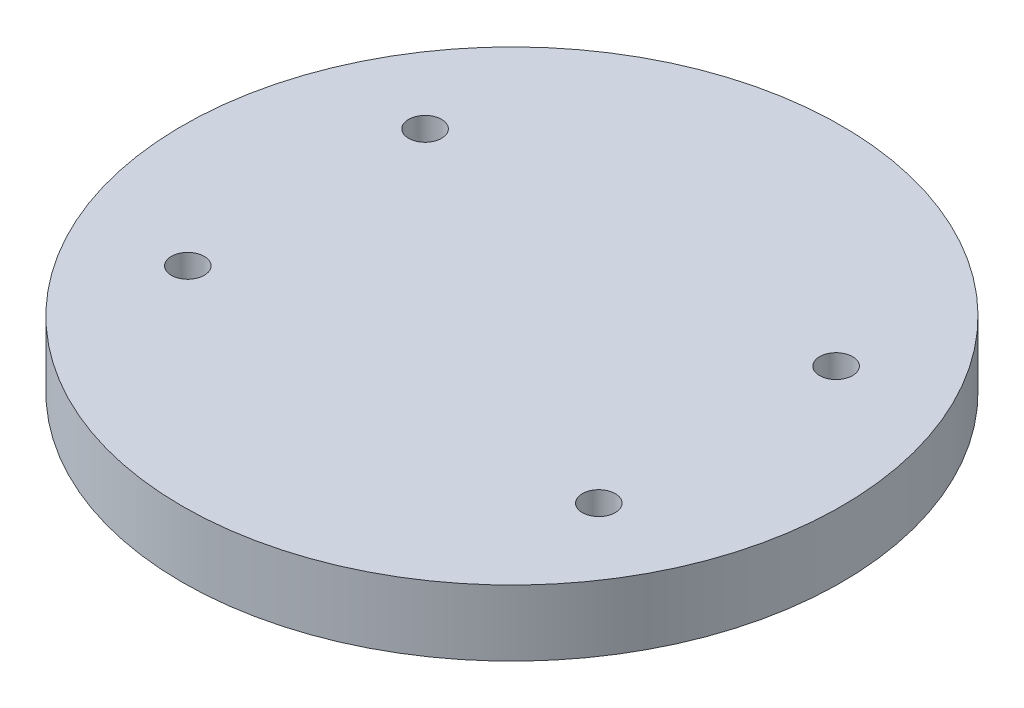
ISO-10303-21;
HEADER;
FILE_DESCRIPTION(('STEP AP214'),'2;1');
FILE_NAME('part.step','',(''),(''),'','','');
FILE_SCHEMA(('AUTOMOTIVE_DESIGN { 1 0 10303 214 1 1 1 1 }'));
ENDSEC;
DATA;
#1=APPLICATION_CONTEXT('core data for automotive mechanical design processes');
#2=APPLICATION_PROTOCOL_DEFINITION('international standard','automotive_design',2000,#1);
#3=PRODUCT_CONTEXT('',#1,'mechanical');
#4=PRODUCT('Part','Part','',(#3));
#5=PRODUCT_RELATED_PRODUCT_CATEGORY('part','',(#4));
#6=PRODUCT_DEFINITION_FORMATION('','',#4);
#7=PRODUCT_DEFINITION_CONTEXT('part definition',#1,'design');
#8=PRODUCT_DEFINITION('design','',#6,#7);
#9=PRODUCT_DEFINITION_SHAPE('','',#8);
#10=(LENGTH_UNIT() NAMED_UNIT(*) SI_UNIT(.MILLI.,.METRE.));
#11=(NAMED_UNIT(*) PLANE_ANGLE_UNIT() SI_UNIT($,.RADIAN.));
#12=(NAMED_UNIT(*) SI_UNIT($,.STERADIAN.) SOLID_ANGLE_UNIT());
#13=UNCERTAINTY_MEASURE_WITH_UNIT(LENGTH_MEASURE(1.E-05),#10,'distance_accuracy_value','');
#14=(GEOMETRIC_REPRESENTATION_CONTEXT(3) GLOBAL_UNCERTAINTY_ASSIGNED_CONTEXT((#13)) GLOBAL_UNIT_ASSIGNED_CONTEXT((#10,
#11,#12)) REPRESENTATION_CONTEXT('',''));
#15=CARTESIAN_POINT('',(0.,0.,0.));
#16=DIRECTION('',(0.,0.,1.));
#17=DIRECTION('',(1.,0.,0.));
#18=AXIS2_PLACEMENT_3D('',#15,#16,#17);
#19=CARTESIAN_POINT('',(0.,10.,0.));
#20=DIRECTION('',(0.,1.,0.));
#21=DIRECTION('',(0.,0.,1.));
#22=AXIS2_PLACEMENT_3D('',#19,#20,#21);
#23=PLANE('',#22);
#24=CARTESIAN_POINT('',(31.1769145362398,10.,-17.9999999999999));
#25=DIRECTION('',(0.,1.,0.));
#26=DIRECTION('',(0.,0.,1.));
#27=AXIS2_PLACEMENT_3D('',#24,#25,#26);
#28=CIRCLE('',#27,2.5);
#29=CARTESIAN_POINT('',(31.1769145362398,10.,-15.4999999999999));
#30=VERTEX_POINT('',#29);
#31=EDGE_CURVE('E71',#30,#30,#28,.T.);
#32=ORIENTED_EDGE('',*,*,#31,.F.);
#33=EDGE_LOOP('',(#32));
#34=FACE_BOUND('',#33,.T.);
#35=CARTESIAN_POINT('',(-31.1769145362398,10.,-17.9999999999999));
#36=DIRECTION('',(0.,1.,0.));
#37=DIRECTION('',(0.,0.,1.));
#38=AXIS2_PLACEMENT_3D('',#35,#36,#37);
#39=CIRCLE('',#38,2.5);
#40=CARTESIAN_POINT('',(-31.1769145362398,10.,-15.4999999999999));
#41=VERTEX_POINT('',#40);
#42=EDGE_CURVE('E83',#41,#41,#39,.T.);
#43=ORIENTED_EDGE('',*,*,#42,.F.);
#44=EDGE_LOOP('',(#43));
#45=FACE_BOUND('',#44,.T.);
#46=CARTESIAN_POINT('',(0.,10.,0.));
#47=DIRECTION('',(0.,1.,0.));
#48=DIRECTION('',(0.,0.,1.));
#49=AXIS2_PLACEMENT_3D('',#46,#47,#48);
#50=CIRCLE('',#49,50.);
#51=CARTESIAN_POINT('',(0.,10.,50.));
#52=VERTEX_POINT('',#51);
#53=EDGE_CURVE('E54',#52,#52,#50,.T.);
#54=ORIENTED_EDGE('',*,*,#53,.T.);
#55=EDGE_LOOP('',(#54));
#56=FACE_BOUND('',#55,.T.);
#57=CARTESIAN_POINT('',(-31.1769145362398,10.,17.9999999999999));
#58=DIRECTION('',(0.,1.,0.));
#59=DIRECTION('',(0.,0.,1.));
#60=AXIS2_PLACEMENT_3D('',#57,#58,#59);
#61=CIRCLE('',#60,2.5);
#62=CARTESIAN_POINT('',(-31.1769145362398,10.,20.4999999999999));
#63=VERTEX_POINT('',#62);
#64=EDGE_CURVE('E77',#63,#63,#61,.T.);
#65=ORIENTED_EDGE('',*,*,#64,.F.);
#66=EDGE_LOOP('',(#65));
#67=FACE_BOUND('',#66,.T.);
#68=CARTESIAN_POINT('',(31.1769145362398,10.,17.9999999999999));
#69=DIRECTION('',(0.,1.,0.));
#70=DIRECTION('',(0.,0.,1.));
#71=AXIS2_PLACEMENT_3D('',#68,#69,#70);
#72=CIRCLE('',#71,2.5);
#73=CARTESIAN_POINT('',(31.1769145362398,10.,20.4999999999999));
#74=VERTEX_POINT('',#73);
#75=EDGE_CURVE('E64',#74,#74,#72,.T.);
#76=ORIENTED_EDGE('',*,*,#75,.F.);
#77=EDGE_LOOP('',(#76));
#78=FACE_BOUND('',#77,.T.);
#79=ADVANCED_FACE('F41',(#34,#45,#56,#67,#78),#23,.T.);
#80=CARTESIAN_POINT('',(0.,0.,0.));
#81=DIRECTION('',(0.,1.,0.));
#82=DIRECTION('',(0.,0.,1.));
#83=AXIS2_PLACEMENT_3D('',#80,#81,#82);
#84=PLANE('',#83);
#85=CARTESIAN_POINT('',(0.,0.,0.));
#86=DIRECTION('',(0.,-1.,0.));
#87=DIRECTION('',(0.,0.,-1.));
#88=AXIS2_PLACEMENT_3D('',#85,#86,#87);
#89=CIRCLE('',#88,12.4125);
#90=CARTESIAN_POINT('',(0.,0.,-12.4125));
#91=VERTEX_POINT('',#90);
#92=EDGE_CURVE('E10',#91,#91,#89,.T.);
#93=ORIENTED_EDGE('',*,*,#92,.F.);
#94=EDGE_LOOP('',(#93));
#95=FACE_BOUND('',#94,.T.);
#96=CARTESIAN_POINT('',(0.,0.,0.));
#97=DIRECTION('',(0.,1.,0.));
#98=DIRECTION('',(0.,0.,1.));
#99=AXIS2_PLACEMENT_3D('',#96,#97,#98);
#100=CIRCLE('',#99,50.);
#101=CARTESIAN_POINT('',(0.,0.,50.));
#102=VERTEX_POINT('',#101);
#103=EDGE_CURVE('E59',#102,#102,#100,.T.);
#104=ORIENTED_EDGE('',*,*,#103,.F.);
#105=EDGE_LOOP('',(#104));
#106=FACE_BOUND('',#105,.T.);
#107=CARTESIAN_POINT('',(-31.1769145362398,0.,-17.9999999999999));
#108=DIRECTION('',(0.,1.,0.));
#109=DIRECTION('',(0.,0.,1.));
#110=AXIS2_PLACEMENT_3D('',#107,#108,#109);
#111=CIRCLE('',#110,2.5);
#112=CARTESIAN_POINT('',(-31.1769145362398,0.,-15.4999999999999));
#113=VERTEX_POINT('',#112);
#114=EDGE_CURVE('E80',#113,#113,#111,.T.);
#115=ORIENTED_EDGE('',*,*,#114,.T.);
#116=EDGE_LOOP('',(#115));
#117=FACE_BOUND('',#116,.T.);
#118=CARTESIAN_POINT('',(-31.1769145362398,0.,17.9999999999999));
#119=DIRECTION('',(0.,1.,0.));
#120=DIRECTION('',(0.,0.,1.));
#121=AXIS2_PLACEMENT_3D('',#118,#119,#120);
#122=CIRCLE('',#121,2.5);
#123=CARTESIAN_POINT('',(-31.1769145362398,0.,20.4999999999999));
#124=VERTEX_POINT('',#123);
#125=EDGE_CURVE('E74',#124,#124,#122,.T.);
#126=ORIENTED_EDGE('',*,*,#125,.T.);
#127=EDGE_LOOP('',(#126));
#128=FACE_BOUND('',#127,.T.);
#129=CARTESIAN_POINT('',(31.1769145362398,0.,-17.9999999999999));
#130=DIRECTION('',(0.,1.,0.));
#131=DIRECTION('',(0.,0.,1.));
#132=AXIS2_PLACEMENT_3D('',#129,#130,#131);
#133=CIRCLE('',#132,2.5);
#134=CARTESIAN_POINT('',(31.1769145362398,0.,-15.4999999999999));
#135=VERTEX_POINT('',#134);
#136=EDGE_CURVE('E67',#135,#135,#133,.T.);
#137=ORIENTED_EDGE('',*,*,#136,.T.);
#138=EDGE_LOOP('',(#137));
#139=FACE_BOUND('',#138,.T.);
#140=CARTESIAN_POINT('',(31.1769145362398,0.,17.9999999999999));
#141=DIRECTION('',(0.,1.,0.));
#142=DIRECTION('',(0.,0.,1.));
#143=AXIS2_PLACEMENT_3D('',#140,#141,#142);
#144=CIRCLE('',#143,2.5);
#145=CARTESIAN_POINT('',(31.1769145362398,0.,20.4999999999999));
#146=VERTEX_POINT('',#145);
#147=EDGE_CURVE('E68',#146,#146,#144,.T.);
#148=ORIENTED_EDGE('',*,*,#147,.T.);
#149=EDGE_LOOP('',(#148));
#150=FACE_BOUND('',#149,.T.);
#151=ADVANCED_FACE('F113',(#95,#106,#117,#128,#139,#150),#84,.F.);
#152=CARTESIAN_POINT('',(0.,10.,0.));
#153=DIRECTION('',(0.,-1.,0.));
#154=DIRECTION('',(0.,0.,-1.));
#155=AXIS2_PLACEMENT_3D('',#152,#153,#154);
#156=CYLINDRICAL_SURFACE('',#155,50.);
#157=ORIENTED_EDGE('',*,*,#53,.F.);
#158=EDGE_LOOP('',(#157));
#159=FACE_BOUND('',#158,.T.);
#160=ORIENTED_EDGE('',*,*,#103,.T.);
#161=EDGE_LOOP('',(#160));
#162=FACE_BOUND('',#161,.T.);
#163=ADVANCED_FACE('F43',(#159,#162),#156,.T.);
#164=CARTESIAN_POINT('',(-31.1769145362398,10.,-17.9999999999999));
#165=DIRECTION('',(0.,-1.,0.));
#166=DIRECTION('',(0.,0.,-1.));
#167=AXIS2_PLACEMENT_3D('',#164,#165,#166);
#168=CYLINDRICAL_SURFACE('',#167,2.5);
#169=ORIENTED_EDGE('',*,*,#42,.T.);
#170=EDGE_LOOP('',(#169));
#171=FACE_BOUND('',#170,.T.);
#172=ORIENTED_EDGE('',*,*,#114,.F.);
#173=EDGE_LOOP('',(#172));
#174=FACE_BOUND('',#173,.T.);
#175=ADVANCED_FACE('F123',(#171,#174),#168,.F.);
#176=CARTESIAN_POINT('',(-31.1769145362398,10.,17.9999999999999));
#177=DIRECTION('',(0.,-1.,0.));
#178=DIRECTION('',(0.,0.,-1.));
#179=AXIS2_PLACEMENT_3D('',#176,#177,#178);
#180=CYLINDRICAL_SURFACE('',#179,2.5);
#181=ORIENTED_EDGE('',*,*,#64,.T.);
#182=EDGE_LOOP('',(#181));
#183=FACE_BOUND('',#182,.T.);
#184=ORIENTED_EDGE('',*,*,#125,.F.);
#185=EDGE_LOOP('',(#184));
#186=FACE_BOUND('',#185,.T.);
#187=ADVANCED_FACE('F126',(#183,#186),#180,.F.);
#188=CARTESIAN_POINT('',(31.1769145362398,10.,-17.9999999999999));
#189=DIRECTION('',(0.,-1.,0.));
#190=DIRECTION('',(0.,0.,-1.));
#191=AXIS2_PLACEMENT_3D('',#188,#189,#190);
#192=CYLINDRICAL_SURFACE('',#191,2.5);
#193=ORIENTED_EDGE('',*,*,#31,.T.);
#194=EDGE_LOOP('',(#193));
#195=FACE_BOUND('',#194,.T.);
#196=ORIENTED_EDGE('',*,*,#136,.F.);
#197=EDGE_LOOP('',(#196));
#198=FACE_BOUND('',#197,.T.);
#199=ADVANCED_FACE('F130',(#195,#198),#192,.F.);
#200=CARTESIAN_POINT('',(31.1769145362398,10.,17.9999999999999));
#201=DIRECTION('',(0.,-1.,0.));
#202=DIRECTION('',(0.,0.,-1.));
#203=AXIS2_PLACEMENT_3D('',#200,#201,#202);
#204=CYLINDRICAL_SURFACE('',#203,2.5);
#205=ORIENTED_EDGE('',*,*,#75,.T.);
#206=EDGE_LOOP('',(#205));
#207=FACE_BOUND('',#206,.T.);
#208=ORIENTED_EDGE('',*,*,#147,.F.);
#209=EDGE_LOOP('',(#208));
#210=FACE_BOUND('',#209,.T.);
#211=ADVANCED_FACE('F109',(#207,#210),#204,.F.);
#212=CARTESIAN_POINT('',(0.,-20.,0.));
#213=DIRECTION('',(0.,1.,0.));
#214=DIRECTION('',(0.,0.,1.));
#215=AXIS2_PLACEMENT_3D('',#212,#213,#214);
#216=CYLINDRICAL_SURFACE('',#215,12.4125);
#217=CARTESIAN_POINT('',(0.,-12.5,12.4125));
#218=CARTESIAN_POINT('',(-0.138921591728759,-12.499994914029,12.4124974369134));
#219=CARTESIAN_POINT('',(-0.277907267535855,-12.488381352472,12.4101438496571));
#220=CARTESIAN_POINT('',(-0.551948671313862,-12.4422716630298,12.400981965007));
#221=CARTESIAN_POINT('',(-0.687001212094762,-12.4077574883618,12.3941701543768));
#222=CARTESIAN_POINT('',(-0.949174669780114,-12.3169571599381,12.3768523010227));
#223=CARTESIAN_POINT('',(-1.07630309721216,-12.2606919978229,12.3663498210098));
#224=CARTESIAN_POINT('',(-1.31930697806888,-12.1280495492092,12.3427917538294));
#225=CARTESIAN_POINT('',(-1.43518307337865,-12.0516734108574,12.3297363124229));
#226=CARTESIAN_POINT('',(-1.65399186324694,-11.8798658641922,12.3023083744865));
#227=CARTESIAN_POINT('',(-1.75674788037196,-11.7842116933117,12.2879216569491));
#228=CARTESIAN_POINT('',(-1.94486966539731,-11.5770421717167,12.2595558623109));
#229=CARTESIAN_POINT('',(-2.03023406186985,-11.4655255713363,12.2455768174319));
#230=CARTESIAN_POINT('',(-2.18190342432836,-11.2285233150593,12.2194701616987));
#231=CARTESIAN_POINT('',(-2.24802507705793,-11.1029181546341,12.2073608429957));
#232=CARTESIAN_POINT('',(-2.35815752206747,-10.84209646345,12.1865668212734));
#233=CARTESIAN_POINT('',(-2.40217053141263,-10.7068808979801,12.1778817748852));
#234=CARTESIAN_POINT('',(-2.46626200756847,-10.4325786976578,12.1650635998516));
#235=CARTESIAN_POINT('',(-2.48665066299639,-10.2935673497756,12.1608715344462));
#236=CARTESIAN_POINT('',(-2.50387821987751,-10.0140386807919,12.1573365931586));
#237=CARTESIAN_POINT('',(-2.50071956416062,-9.87352151741611,12.157993214267));
#238=CARTESIAN_POINT('',(-2.47119286749076,-9.59724201957568,12.1640279218906));
#239=CARTESIAN_POINT('',(-2.44518075609486,-9.46143982820369,12.1693335986677));
#240=CARTESIAN_POINT('',(-2.37124750782755,-9.19616724170126,12.1839545532904));
#241=CARTESIAN_POINT('',(-2.32332531130161,-9.06669715315054,12.1932700250637));
#242=CARTESIAN_POINT('',(-2.20659331412626,-8.81674002964637,12.2149347872822));
#243=CARTESIAN_POINT('',(-2.13764274261922,-8.69632057145015,12.2273044135748));
#244=CARTESIAN_POINT('',(-1.98091054868774,-8.4686276146052,12.2536707261592));
#245=CARTESIAN_POINT('',(-1.8931267327399,-8.36135564954449,12.2676676018911));
#246=CARTESIAN_POINT('',(-1.69931577797225,-8.16094927076198,12.2960247944772));
#247=CARTESIAN_POINT('',(-1.59298493770287,-8.06810859358552,12.310387082314));
#248=CARTESIAN_POINT('',(-1.36610670420562,-7.90153451715601,12.3376230130229));
#249=CARTESIAN_POINT('',(-1.2455591237019,-7.82780136964566,12.3504966362805));
#250=CARTESIAN_POINT('',(-0.993340700010635,-7.70147971507771,12.3733370582776));
#251=CARTESIAN_POINT('',(-0.861652411989317,-7.64892514102257,12.3832991851618));
#252=CARTESIAN_POINT('',(-0.5910704287003,-7.56676755806638,12.3991587509779));
#253=CARTESIAN_POINT('',(-0.452177621094582,-7.53716172880497,12.4050566893815));
#254=CARTESIAN_POINT('',(-0.173653109993879,-7.50215872088174,12.4120536698454));
#255=CARTESIAN_POINT('',(-0.034073858039491,-7.49635961343644,12.4132323781256));
#256=CARTESIAN_POINT('',(0.244059179010124,-7.50805171602579,12.4108795126395));
#257=CARTESIAN_POINT('',(0.382613022151189,-7.5255415974303,12.4073482075781));
#258=CARTESIAN_POINT('',(0.653463019734048,-7.58298132732106,12.3960219809523));
#259=CARTESIAN_POINT('',(0.785804764796529,-7.62272461353821,12.38826628909));
#260=CARTESIAN_POINT('',(1.04194560480176,-7.72331700815358,12.3693578617059));
#261=CARTESIAN_POINT('',(1.1657440521567,-7.7841677144064,12.3582048690124));
#262=CARTESIAN_POINT('',(1.40297680547654,-7.92611480444035,12.3335407300464));
#263=CARTESIAN_POINT('',(1.51626365482945,-8.00745274712033,12.3200020721183));
#264=CARTESIAN_POINT('',(1.7277246054604,-8.18774237378683,12.2921324386688));
#265=CARTESIAN_POINT('',(1.82589705969465,-8.28669597485454,12.2778013770286));
#266=CARTESIAN_POINT('',(2.00589645419209,-8.50123880482055,12.2496931147391));
#267=CARTESIAN_POINT('',(2.08744728717794,-8.61706152833012,12.2359278990499));
#268=CARTESIAN_POINT('',(2.22993768007303,-8.86099734531735,12.2107653755042));
#269=CARTESIAN_POINT('',(2.29087807066329,-8.98910994319805,12.1993679722229));
#270=CARTESIAN_POINT('',(2.39004246752288,-9.25333963007611,12.1803286583947));
#271=CARTESIAN_POINT('',(2.42838510966378,-9.38941071743671,12.1726671719837));
#272=CARTESIAN_POINT('',(2.48162460673891,-9.66623522482711,12.1619260985888));
#273=CARTESIAN_POINT('',(2.49652456805273,-9.8069880219611,12.1588459045426));
#274=CARTESIAN_POINT('',(2.50233951395926,-10.0864075130139,12.1576502044499));
#275=CARTESIAN_POINT('',(2.49369089634753,-10.2250649222857,12.1594443663927));
#276=CARTESIAN_POINT('',(2.45361823133643,-10.4989049632433,12.1675932141195));
#277=CARTESIAN_POINT('',(2.42219437266156,-10.6340876237125,12.1739478621136));
#278=CARTESIAN_POINT('',(2.33765910260804,-10.896858160787,12.1904610161634));
#279=CARTESIAN_POINT('',(2.28460193150435,-11.0244641240213,12.200610003586));
#280=CARTESIAN_POINT('',(2.15835652970054,-11.2690310498891,12.2235736087955));
#281=CARTESIAN_POINT('',(2.08516658055146,-11.385991102698,12.236388454106));
#282=CARTESIAN_POINT('',(1.91924582300071,-11.6081175953633,12.2635157842489));
#283=CARTESIAN_POINT('',(1.82620015525939,-11.7130462034158,12.2778502627281));
#284=CARTESIAN_POINT('',(1.6238583783502,-11.9059448321278,12.3062446180076));
#285=CARTESIAN_POINT('',(1.51455853887022,-11.9939109492455,12.3203044309323));
#286=CARTESIAN_POINT('',(1.28141312241448,-12.1512723688558,12.346741778824));
#287=CARTESIAN_POINT('',(1.15742514570491,-12.2204601077656,12.3590998215326));
#288=CARTESIAN_POINT('',(0.899367382198424,-12.3369080525554,12.3805491173738));
#289=CARTESIAN_POINT('',(0.765306763328971,-12.3841879241993,12.3896432986763));
#290=CARTESIAN_POINT('',(0.52579717941197,-12.4463737959313,12.4017838302633));
#291=CARTESIAN_POINT('',(0.421707052882056,-12.4664475897274,12.4057787782604));
#292=CARTESIAN_POINT('',(0.211756991383291,-12.4932624123472,12.41113779703));
#293=CARTESIAN_POINT('',(0.105897114372068,-12.5000038769326,12.412501953789));
#294=CARTESIAN_POINT('',(0.,-12.5,12.4125));
#295=B_SPLINE_CURVE_WITH_KNOTS('',3,(#217,#218,#219,#220,#221,#222,#223,#224,#225,#226,#227,
#228,#229,#230,#231,#232,#233,#234,#235,#236,#237,#238,#239,#240,#241,#242,#243,#244,#245,#246,
#247,#248,#249,#250,#251,#252,#253,#254,#255,#256,#257,#258,#259,#260,#261,#262,#263,#264,#265,
#266,#267,#268,#269,#270,#271,#272,#273,#274,#275,#276,#277,#278,#279,#280,#281,#282,#283,#284,
#285,#286,#287,#288,#289,#290,#291,#292,#293,#294),.UNSPECIFIED.,.T.,.F.,(4,2,2,2,2,2,2,2,2,2,2,
2,2,2,2,2,2,2,2,2,2,2,2,2,2,2,2,2,2,2,2,2,2,2,2,2,2,2,4),(0.,0.416377355943097,
0.833083227565542,1.24938794085575,1.66566889223121,2.08706858927194,2.50850150321503,
2.93382674005859,3.35910931656745,3.77874227316483,4.19833169707768,4.61149984454752,
5.02468797650512,5.44070520948725,5.85677092266715,6.28042978820144,6.70409423517964,
7.12843481776117,7.55272324135974,7.96981818458514,8.38688933368316,8.80015180170646,
9.21344556097701,9.63186127115473,10.0503225446482,10.4752519614824,10.9001642499663,
11.3228254495746,11.7454306378102,12.1602577492123,12.5750814232351,12.9888713614203,
13.4026966299332,13.8236496385412,14.2446994048565,14.6702293776758,15.0953766267291,
15.4127830224774,15.7301790437549),.UNSPECIFIED.);
#296=CARTESIAN_POINT('',(0.,-12.5,12.4125));
#297=VERTEX_POINT('',#296);
#298=EDGE_CURVE('E45',#297,#297,#295,.T.);
#299=ORIENTED_EDGE('',*,*,#298,.T.);
#300=EDGE_LOOP('',(#299));
#301=FACE_BOUND('',#300,.T.);
#302=CARTESIAN_POINT('',(2.5,-10.,-12.1581312811632));
#303=CARTESIAN_POINT('',(2.49999488939382,-9.86111062460408,-12.1581340487871));
#304=CARTESIAN_POINT('',(2.48838653126037,-9.7221570996239,-12.1605370806786));
#305=CARTESIAN_POINT('',(2.442299382168,-9.44818245035807,-12.1698751926488));
#306=CARTESIAN_POINT('',(2.40780241936471,-9.31316453964182,-12.1768138736298));
#307=CARTESIAN_POINT('',(2.31705240954339,-9.05106442767419,-12.1944062820333));
#308=CARTESIAN_POINT('',(2.26082116256065,-8.92397442241068,-12.2050562858555));
#309=CARTESIAN_POINT('',(2.1282586640727,-8.68103533232757,-12.228866921036));
#310=CARTESIAN_POINT('',(2.05192848268682,-8.56518564949335,-12.2420274187189));
#311=CARTESIAN_POINT('',(1.88016808046772,-8.34634875374697,-12.2695870185694));
#312=CARTESIAN_POINT('',(1.7845047750595,-8.2435461867399,-12.2839998769947));
#313=CARTESIAN_POINT('',(1.57729721787138,-8.05533406910582,-12.3123192046501));
#314=CARTESIAN_POINT('',(1.46575184535505,-7.9699257469584,-12.3262256380568));
#315=CARTESIAN_POINT('',(1.22872268025819,-7.81820904860757,-12.3521137051385));
#316=CARTESIAN_POINT('',(1.10312432884291,-7.75207629352598,-12.364077225976));
#317=CARTESIAN_POINT('',(0.842317360335114,-7.64192146646508,-12.3845769120317));
#318=CARTESIAN_POINT('',(0.707109657050435,-7.59789729525798,-12.3931134026336));
#319=CARTESIAN_POINT('',(0.432838541413155,-7.53378454609592,-12.4057000108202));
#320=CARTESIAN_POINT('',(0.293850750639103,-7.51338411919766,-12.4098085290664));
#321=CARTESIAN_POINT('',(0.0143687259356038,-7.49612484734573,-12.413278018663));
#322=CARTESIAN_POINT('',(-0.126125359524875,-7.49926370314527,-12.4126394536944));
#323=CARTESIAN_POINT('',(-0.402488481784809,-7.52875767865586,-12.4067319343308));
#324=CARTESIAN_POINT('',(-0.538395010076534,-7.5547768715641,-12.4015299817843));
#325=CARTESIAN_POINT('',(-0.803872552364456,-7.62875992489792,-12.3871558001203));
#326=CARTESIAN_POINT('',(-0.933443310110582,-7.67672467209964,-12.3779834105663));
#327=CARTESIAN_POINT('',(-1.18352772969788,-7.79354747619957,-12.3565887398504));
#328=CARTESIAN_POINT('',(-1.30397835897079,-7.86253683117396,-12.3443473808029));
#329=CARTESIAN_POINT('',(-1.53171749818719,-8.01935328602732,-12.3181637244182));
#330=CARTESIAN_POINT('',(-1.63900447094339,-8.1071825826574,-12.3042212288092));
#331=CARTESIAN_POINT('',(-1.83936468367014,-8.301027625875,-12.2758840767112));
#332=CARTESIAN_POINT('',(-1.93215319355585,-8.40733736729011,-12.2614857839596));
#333=CARTESIAN_POINT('',(-2.09863181790395,-8.6341541923989,-12.2340933519345));
#334=CARTESIAN_POINT('',(-2.17232156085417,-8.75466155220054,-12.2210992399782));
#335=CARTESIAN_POINT('',(-2.29861110142713,-9.00686548394588,-12.1979790849554));
#336=CARTESIAN_POINT('',(-2.35116424977235,-9.13858603650308,-12.1878594001531));
#337=CARTESIAN_POINT('',(-2.43330927215553,-9.4092386574183,-12.1717267654848));
#338=CARTESIAN_POINT('',(-2.46290418494674,-9.54816976878836,-12.1657132721356));
#339=CARTESIAN_POINT('',(-2.49786593609561,-9.82671761175042,-12.1585829103965));
#340=CARTESIAN_POINT('',(-2.50364419505213,-9.96628063302893,-12.1573829013691));
#341=CARTESIAN_POINT('',(-2.49191619747821,-10.2443763507491,-12.1597921283947));
#342=CARTESIAN_POINT('',(-2.47441128120069,-10.3829091060346,-12.1634010876283));
#343=CARTESIAN_POINT('',(-2.41696868868252,-10.6536253825141,-12.1749437071911));
#344=CARTESIAN_POINT('',(-2.37725132985978,-10.7858576288892,-12.1828348713551));
#345=CARTESIAN_POINT('',(-2.27674707120443,-11.0417908284391,-12.2020154235364));
#346=CARTESIAN_POINT('',(-2.21595841482708,-11.165491069338,-12.2133050948495));
#347=CARTESIAN_POINT('',(-2.0741076186317,-11.40264769766,-12.2381970841965));
#348=CARTESIAN_POINT('',(-1.99278833262288,-11.5159472200345,-12.25182797587));
#349=CARTESIAN_POINT('',(-1.81252694735504,-11.7274423064879,-12.2797883716776));
#350=CARTESIAN_POINT('',(-1.71358300742569,-11.8256362909881,-12.2941179486669));
#351=CARTESIAN_POINT('',(-1.49903295186991,-12.0056954984256,-12.3221312738844));
#352=CARTESIAN_POINT('',(-1.38319118106258,-12.0872823757969,-12.335801475694));
#353=CARTESIAN_POINT('',(-1.1392063691331,-12.2298359453783,-12.3607192429446));
#354=CARTESIAN_POINT('',(-1.01106384957108,-12.2908035113659,-12.3719669110371));
#355=CARTESIAN_POINT('',(-0.74684242706052,-12.3899834122889,-12.3907145128312));
#356=CARTESIAN_POINT('',(-0.610813998103297,-12.4283259859969,-12.3982358557785));
#357=CARTESIAN_POINT('',(-0.334080531293706,-12.4815797493138,-12.4087752365298));
#358=CARTESIAN_POINT('',(-0.193376067208264,-12.4964938029284,-12.4117938247682));
#359=CARTESIAN_POINT('',(0.0860579114651285,-12.5023549541175,-12.4129743268075));
#360=CARTESIAN_POINT('',(0.224778464526149,-12.4937203188009,-12.4112209995596));
#361=CARTESIAN_POINT('',(0.498748536176944,-12.4536535986699,-12.4032331286276));
#362=CARTESIAN_POINT('',(0.633998099661584,-12.422221808875,-12.3969986429345));
#363=CARTESIAN_POINT('',(0.896921768910421,-12.3376400005679,-12.3807516458956));
#364=CARTESIAN_POINT('',(1.02461283720333,-12.2845409009057,-12.3707479963976));
#365=CARTESIAN_POINT('',(1.26933284348152,-12.1581849757104,-12.348039154729));
#366=CARTESIAN_POINT('',(1.3863609233824,-12.0849265297945,-12.3353337454131));
#367=CARTESIAN_POINT('',(1.60849908078935,-11.9189239425406,-12.3083559622506));
#368=CARTESIAN_POINT('',(1.71338314096774,-11.825880930764,-12.2940613742105));
#369=CARTESIAN_POINT('',(1.90619312524831,-11.6235636120384,-12.2656473509504));
#370=CARTESIAN_POINT('',(1.99411502305061,-11.5142854622322,-12.2515279580587));
#371=CARTESIAN_POINT('',(2.15142075848596,-11.2811636054843,-12.2248925165379));
#372=CARTESIAN_POINT('',(2.22059099276695,-11.1571734670539,-12.2123957239781));
#373=CARTESIAN_POINT('',(2.33700563873491,-10.8991127476188,-12.1906560911015));
#374=CARTESIAN_POINT('',(2.38426984474683,-10.7650513947981,-12.1814103149913));
#375=CARTESIAN_POINT('',(2.44641799011148,-10.5255819116174,-12.169055359029));
#376=CARTESIAN_POINT('',(2.46647510704705,-10.421535030338,-12.1649843476863));
#377=CARTESIAN_POINT('',(2.4932678237466,-10.2116711450141,-12.1595213014967));
#378=CARTESIAN_POINT('',(2.50000389503622,-10.1058542037582,-12.1581291718253));
#379=CARTESIAN_POINT('',(2.5,-10.,-12.1581312811632));
#380=B_SPLINE_CURVE_WITH_KNOTS('',3,(#302,#303,#304,#305,#306,#307,#308,#309,#310,#311,#312,
#313,#314,#315,#316,#317,#318,#319,#320,#321,#322,#323,#324,#325,#326,#327,#328,#329,#330,#331,
#332,#333,#334,#335,#336,#337,#338,#339,#340,#341,#342,#343,#344,#345,#346,#347,#348,#349,#350,
#351,#352,#353,#354,#355,#356,#357,#358,#359,#360,#361,#362,#363,#364,#365,#366,#367,#368,#369,
#370,#371,#372,#373,#374,#375,#376,#377,#378,#379),.UNSPECIFIED.,.T.,.F.,(4,2,2,2,2,2,2,2,2,2,2,
2,2,2,2,2,2,2,2,2,2,2,2,2,2,2,2,2,2,2,2,2,2,2,2,2,2,2,4),(0.,0.416280518335215,
0.832891928440699,1.24908654667,1.66525901009886,2.08678543124709,2.50834161265033,
2.93362646385985,3.35887092629257,3.77843548154138,4.19795905551219,4.61142417883545,
5.02490601093637,5.44102486093539,5.85719225709952,6.28071507233249,6.70424612537836,
7.12870686485558,7.55311141309677,7.97015305018442,8.38717068208044,8.80012360156454,
9.21311095389692,9.63155257150372,10.0500379156502,10.4750455969494,10.9000352655864,
11.3225540303817,11.7450211405954,12.160033573523,12.5750406358417,12.989077984519,
13.4031486227181,13.8239859954149,14.2449231394884,14.670470975669,15.0956335327964,
15.4129119605973,15.7301791574784),.UNSPECIFIED.);
#381=CARTESIAN_POINT('',(2.5,-10.,-12.1581312811632));
#382=VERTEX_POINT('',#381);
#383=EDGE_CURVE('E89',#382,#382,#380,.T.);
#384=ORIENTED_EDGE('',*,*,#383,.T.);
#385=EDGE_LOOP('',(#384));
#386=FACE_BOUND('',#385,.T.);
#387=CARTESIAN_POINT('',(0.,-20.,0.));
#388=DIRECTION('',(0.,-1.,0.));
#389=DIRECTION('',(0.,0.,-1.));
#390=AXIS2_PLACEMENT_3D('',#387,#388,#389);
#391=CIRCLE('',#390,12.4125);
#392=CARTESIAN_POINT('',(0.,-20.,-12.4125));
#393=VERTEX_POINT('',#392);
#394=EDGE_CURVE('E63',#393,#393,#391,.T.);
#395=ORIENTED_EDGE('',*,*,#394,.F.);
#396=EDGE_LOOP('',(#395));
#397=FACE_BOUND('',#396,.T.);
#398=ORIENTED_EDGE('',*,*,#92,.T.);
#399=EDGE_LOOP('',(#398));
#400=FACE_BOUND('',#399,.T.);
#401=ADVANCED_FACE('F94',(#301,#386,#397,#400),#216,.T.);
#402=CARTESIAN_POINT('',(0.,-20.,0.));
#403=DIRECTION('',(0.,-1.,0.));
#404=DIRECTION('',(0.,0.,-1.));
#405=AXIS2_PLACEMENT_3D('',#402,#403,#404);
#406=PLANE('',#405);
#407=ORIENTED_EDGE('',*,*,#394,.T.);
#408=EDGE_LOOP('',(#407));
#409=FACE_BOUND('',#408,.T.);
#410=ADVANCED_FACE('F101',(#409),#406,.T.);
#411=CARTESIAN_POINT('',(0.,-10.,-50.));
#412=DIRECTION('',(0.,0.,1.));
#413=DIRECTION('',(1.,0.,0.));
#414=AXIS2_PLACEMENT_3D('',#411,#412,#413);
#415=CYLINDRICAL_SURFACE('',#414,2.5);
#416=ORIENTED_EDGE('',*,*,#383,.F.);
#417=EDGE_LOOP('',(#416));
#418=FACE_BOUND('',#417,.T.);
#419=ORIENTED_EDGE('',*,*,#298,.F.);
#420=EDGE_LOOP('',(#419));
#421=FACE_BOUND('',#420,.T.);
#422=ADVANCED_FACE('F98',(#418,#421),#415,.F.);
#423=CLOSED_SHELL('',(#79,#151,#163,#175,#187,#199,#211,#401,#410,#422));
#424=MANIFOLD_SOLID_BREP('B2',#423);
#425=ADVANCED_BREP_SHAPE_REPRESENTATION('',(#18,#424),#14);
#426=SHAPE_DEFINITION_REPRESENTATION(#9,#425);
ENDSEC;
END-ISO-10303-21;
